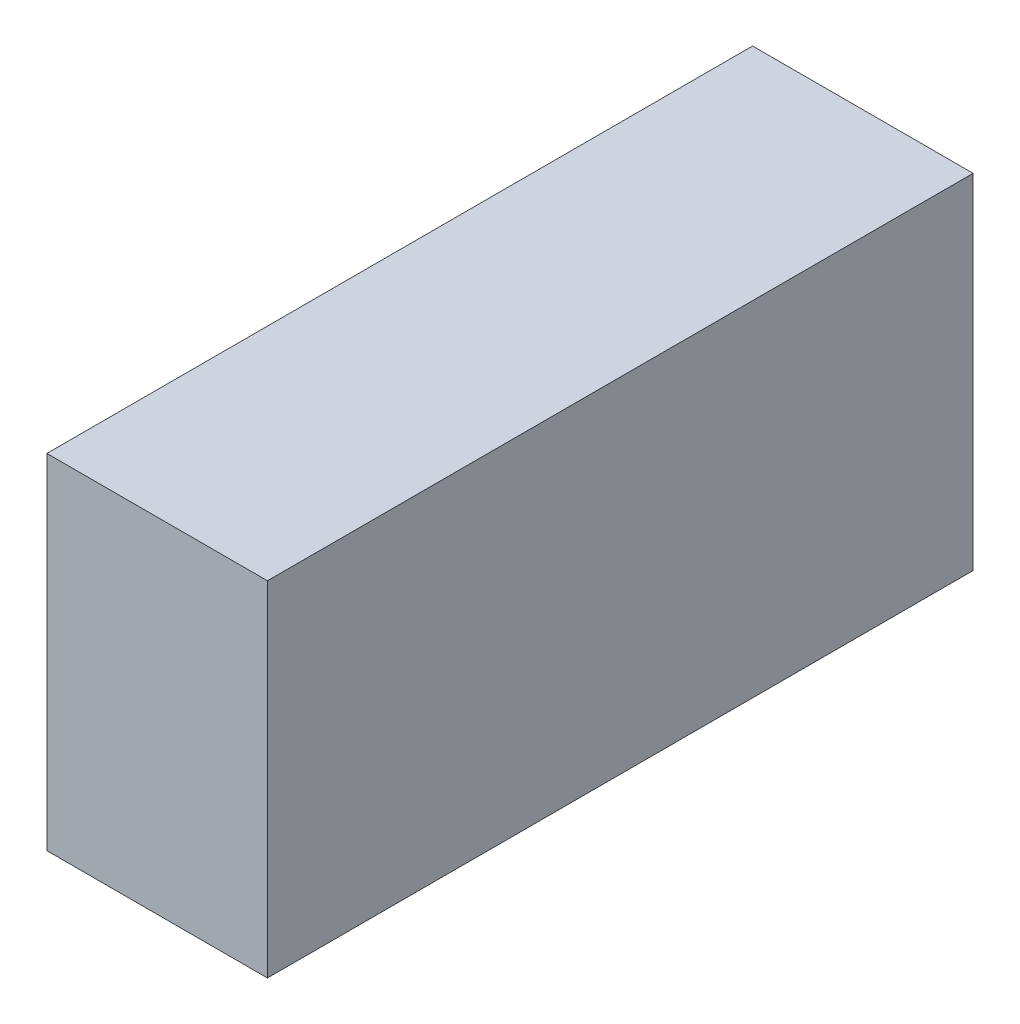
ISO-10303-21;
HEADER;
FILE_DESCRIPTION(('STEP AP214'),'2;1');
FILE_NAME('part.step','',(''),(''),'','','');
FILE_SCHEMA(('AUTOMOTIVE_DESIGN { 1 0 10303 214 1 1 1 1 }'));
ENDSEC;
DATA;
#1=APPLICATION_CONTEXT('core data for automotive mechanical design processes');
#2=APPLICATION_PROTOCOL_DEFINITION('international standard','automotive_design',2000,#1);
#3=PRODUCT_CONTEXT('',#1,'mechanical');
#4=PRODUCT('Part','Part','',(#3));
#5=PRODUCT_RELATED_PRODUCT_CATEGORY('part','',(#4));
#6=PRODUCT_DEFINITION_FORMATION('','',#4);
#7=PRODUCT_DEFINITION_CONTEXT('part definition',#1,'design');
#8=PRODUCT_DEFINITION('design','',#6,#7);
#9=PRODUCT_DEFINITION_SHAPE('','',#8);
#10=(LENGTH_UNIT() NAMED_UNIT(*) SI_UNIT(.MILLI.,.METRE.));
#11=(NAMED_UNIT(*) PLANE_ANGLE_UNIT() SI_UNIT($,.RADIAN.));
#12=(NAMED_UNIT(*) SI_UNIT($,.STERADIAN.) SOLID_ANGLE_UNIT());
#13=UNCERTAINTY_MEASURE_WITH_UNIT(LENGTH_MEASURE(1.E-05),#10,'distance_accuracy_value','');
#14=(GEOMETRIC_REPRESENTATION_CONTEXT(3) GLOBAL_UNCERTAINTY_ASSIGNED_CONTEXT((#13)) GLOBAL_UNIT_ASSIGNED_CONTEXT((#10,
#11,#12)) REPRESENTATION_CONTEXT('',''));
#15=CARTESIAN_POINT('',(0.,0.,0.));
#16=DIRECTION('',(0.,0.,1.));
#17=DIRECTION('',(1.,0.,0.));
#18=AXIS2_PLACEMENT_3D('',#15,#16,#17);
#19=CARTESIAN_POINT('',(0.2499995,-0.38999922,1.59999934));
#20=DIRECTION('',(0.,0.,-1.));
#21=DIRECTION('',(0.,-1.,0.));
#22=AXIS2_PLACEMENT_3D('',#19,#20,#21);
#23=PLANE('',#22);
#24=DIRECTION('',(0.,1.,0.));
#25=VECTOR('',#24,1.);
#26=CARTESIAN_POINT('',(0.2499995,-0.38999922,1.59999934));
#27=LINE('',#26,#25);
#28=CARTESIAN_POINT('',(0.2499995,-0.38999922,1.59999934));
#29=VERTEX_POINT('',#28);
#30=CARTESIAN_POINT('',(0.2499995,0.38999922,1.59999934));
#31=VERTEX_POINT('',#30);
#32=EDGE_CURVE('E92',#29,#31,#27,.T.);
#33=ORIENTED_EDGE('',*,*,#32,.T.);
#34=DIRECTION('',(-1.,0.,0.));
#35=VECTOR('',#34,1.);
#36=CARTESIAN_POINT('',(0.2499995,0.38999922,1.59999934));
#37=LINE('',#36,#35);
#38=CARTESIAN_POINT('',(-0.2499995,0.38999922,1.59999934));
#39=VERTEX_POINT('',#38);
#40=EDGE_CURVE('E87',#31,#39,#37,.T.);
#41=ORIENTED_EDGE('',*,*,#40,.T.);
#42=DIRECTION('',(0.,-1.,0.));
#43=VECTOR('',#42,1.);
#44=CARTESIAN_POINT('',(-0.2499995,0.38999922,1.59999934));
#45=LINE('',#44,#43);
#46=CARTESIAN_POINT('',(-0.2499995,-0.38999922,1.59999934));
#47=VERTEX_POINT('',#46);
#48=EDGE_CURVE('E104',#39,#47,#45,.T.);
#49=ORIENTED_EDGE('',*,*,#48,.T.);
#50=DIRECTION('',(1.,0.,0.));
#51=VECTOR('',#50,1.);
#52=CARTESIAN_POINT('',(-0.2499995,-0.38999922,1.59999934));
#53=LINE('',#52,#51);
#54=EDGE_CURVE('E10',#47,#29,#53,.T.);
#55=ORIENTED_EDGE('',*,*,#54,.T.);
#56=EDGE_LOOP('',(#33,#41,#49,#55));
#57=FACE_BOUND('',#56,.T.);
#58=ADVANCED_FACE('F16',(#57),#23,.F.);
#59=CARTESIAN_POINT('',(0.2499995,-0.38999922,0.));
#60=DIRECTION('',(0.,0.,-1.));
#61=DIRECTION('',(0.,-1.,0.));
#62=AXIS2_PLACEMENT_3D('',#59,#60,#61);
#63=PLANE('',#62);
#64=DIRECTION('',(1.,0.,0.));
#65=VECTOR('',#64,1.);
#66=CARTESIAN_POINT('',(-0.2499995,-0.38999922,0.));
#67=LINE('',#66,#65);
#68=CARTESIAN_POINT('',(-0.2499995,-0.38999922,0.));
#69=VERTEX_POINT('',#68);
#70=CARTESIAN_POINT('',(0.2499995,-0.38999922,0.));
#71=VERTEX_POINT('',#70);
#72=EDGE_CURVE('E27',#69,#71,#67,.T.);
#73=ORIENTED_EDGE('',*,*,#72,.F.);
#74=DIRECTION('',(0.,-1.,0.));
#75=VECTOR('',#74,1.);
#76=CARTESIAN_POINT('',(-0.2499995,0.38999922,0.));
#77=LINE('',#76,#75);
#78=CARTESIAN_POINT('',(-0.2499995,0.38999922,0.));
#79=VERTEX_POINT('',#78);
#80=EDGE_CURVE('E75',#79,#69,#77,.T.);
#81=ORIENTED_EDGE('',*,*,#80,.F.);
#82=DIRECTION('',(-1.,0.,0.));
#83=VECTOR('',#82,1.);
#84=CARTESIAN_POINT('',(0.2499995,0.38999922,0.));
#85=LINE('',#84,#83);
#86=CARTESIAN_POINT('',(0.2499995,0.38999922,0.));
#87=VERTEX_POINT('',#86);
#88=EDGE_CURVE('E69',#87,#79,#85,.T.);
#89=ORIENTED_EDGE('',*,*,#88,.F.);
#90=DIRECTION('',(0.,1.,0.));
#91=VECTOR('',#90,1.);
#92=CARTESIAN_POINT('',(0.2499995,-0.38999922,0.));
#93=LINE('',#92,#91);
#94=EDGE_CURVE('E73',#71,#87,#93,.T.);
#95=ORIENTED_EDGE('',*,*,#94,.F.);
#96=EDGE_LOOP('',(#73,#81,#89,#95));
#97=FACE_BOUND('',#96,.T.);
#98=ADVANCED_FACE('F71',(#97),#63,.T.);
#99=CARTESIAN_POINT('',(-0.2499995,-0.38999922,0.));
#100=DIRECTION('',(0.,1.,0.));
#101=DIRECTION('',(1.,0.,0.));
#102=AXIS2_PLACEMENT_3D('',#99,#100,#101);
#103=PLANE('',#102);
#104=ORIENTED_EDGE('',*,*,#72,.T.);
#105=DIRECTION('',(0.,0.,1.));
#106=VECTOR('',#105,1.);
#107=CARTESIAN_POINT('',(0.2499995,-0.38999922,0.));
#108=LINE('',#107,#106);
#109=EDGE_CURVE('E81',#71,#29,#108,.T.);
#110=ORIENTED_EDGE('',*,*,#109,.T.);
#111=ORIENTED_EDGE('',*,*,#54,.F.);
#112=DIRECTION('',(0.,0.,1.));
#113=VECTOR('',#112,1.);
#114=CARTESIAN_POINT('',(-0.2499995,-0.38999922,0.));
#115=LINE('',#114,#113);
#116=EDGE_CURVE('E20',#69,#47,#115,.T.);
#117=ORIENTED_EDGE('',*,*,#116,.F.);
#118=EDGE_LOOP('',(#104,#110,#111,#117));
#119=FACE_BOUND('',#118,.T.);
#120=ADVANCED_FACE('F18',(#119),#103,.F.);
#121=CARTESIAN_POINT('',(-0.2499995,0.38999922,0.));
#122=DIRECTION('',(1.,0.,0.));
#123=DIRECTION('',(0.,1.,0.));
#124=AXIS2_PLACEMENT_3D('',#121,#122,#123);
#125=PLANE('',#124);
#126=ORIENTED_EDGE('',*,*,#80,.T.);
#127=ORIENTED_EDGE('',*,*,#116,.T.);
#128=ORIENTED_EDGE('',*,*,#48,.F.);
#129=DIRECTION('',(0.,0.,1.));
#130=VECTOR('',#129,1.);
#131=CARTESIAN_POINT('',(-0.2499995,0.38999922,0.));
#132=LINE('',#131,#130);
#133=EDGE_CURVE('E80',#79,#39,#132,.T.);
#134=ORIENTED_EDGE('',*,*,#133,.F.);
#135=EDGE_LOOP('',(#126,#127,#128,#134));
#136=FACE_BOUND('',#135,.T.);
#137=ADVANCED_FACE('F120',(#136),#125,.F.);
#138=CARTESIAN_POINT('',(0.2499995,0.38999922,0.));
#139=DIRECTION('',(0.,-1.,0.));
#140=DIRECTION('',(0.,0.,-1.));
#141=AXIS2_PLACEMENT_3D('',#138,#139,#140);
#142=PLANE('',#141);
#143=ORIENTED_EDGE('',*,*,#88,.T.);
#144=ORIENTED_EDGE('',*,*,#133,.T.);
#145=ORIENTED_EDGE('',*,*,#40,.F.);
#146=DIRECTION('',(0.,0.,1.));
#147=VECTOR('',#146,1.);
#148=CARTESIAN_POINT('',(0.2499995,0.38999922,0.));
#149=LINE('',#148,#147);
#150=EDGE_CURVE('E84',#87,#31,#149,.T.);
#151=ORIENTED_EDGE('',*,*,#150,.F.);
#152=EDGE_LOOP('',(#143,#144,#145,#151));
#153=FACE_BOUND('',#152,.T.);
#154=ADVANCED_FACE('F85',(#153),#142,.F.);
#155=CARTESIAN_POINT('',(0.2499995,-0.38999922,0.));
#156=DIRECTION('',(-1.,0.,0.));
#157=DIRECTION('',(0.,0.,1.));
#158=AXIS2_PLACEMENT_3D('',#155,#156,#157);
#159=PLANE('',#158);
#160=ORIENTED_EDGE('',*,*,#94,.T.);
#161=ORIENTED_EDGE('',*,*,#150,.T.);
#162=ORIENTED_EDGE('',*,*,#32,.F.);
#163=ORIENTED_EDGE('',*,*,#109,.F.);
#164=EDGE_LOOP('',(#160,#161,#162,#163));
#165=FACE_BOUND('',#164,.T.);
#166=ADVANCED_FACE('F94',(#165),#159,.F.);
#167=CLOSED_SHELL('',(#58,#98,#120,#137,#154,#166));
#168=MANIFOLD_SOLID_BREP('B1',#167);
#169=ADVANCED_BREP_SHAPE_REPRESENTATION('',(#18,#168),#14);
#170=SHAPE_DEFINITION_REPRESENTATION(#9,#169);
ENDSEC;
END-ISO-10303-21;
